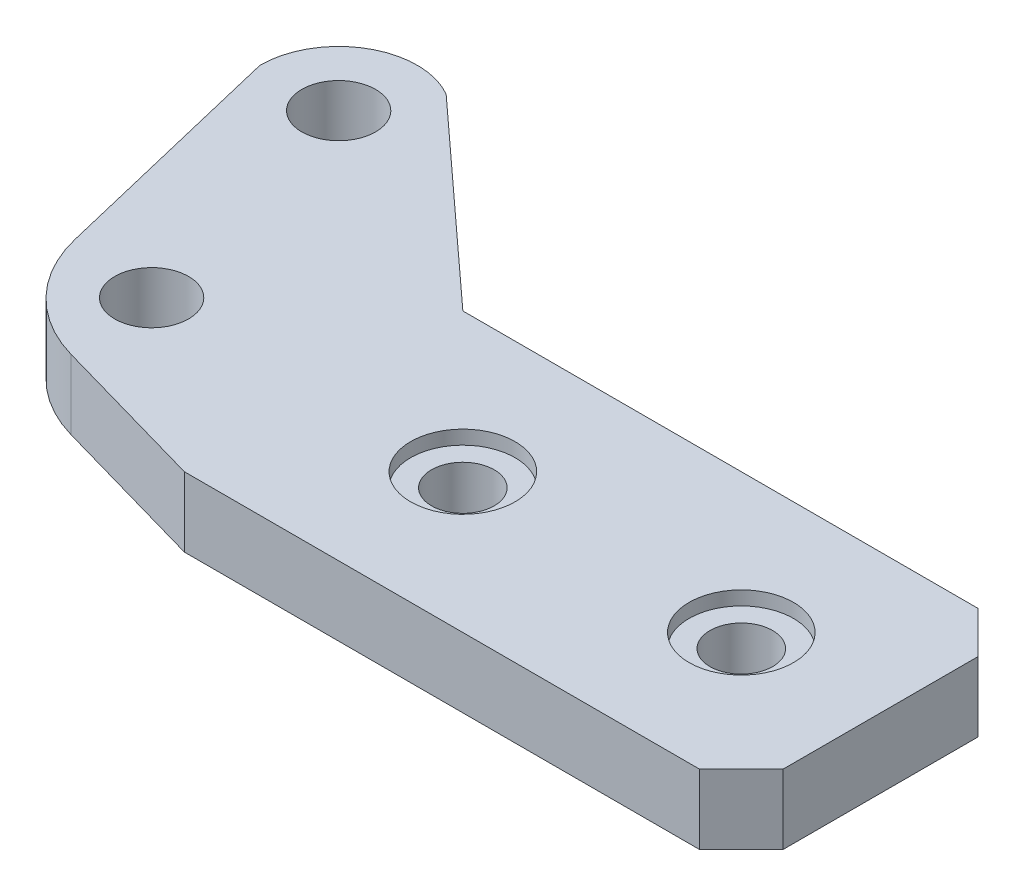
ISO-10303-21;
HEADER;
FILE_DESCRIPTION(('STEP AP214'),'2;1');
FILE_NAME('part.step','',(''),(''),'','','');
FILE_SCHEMA(('AUTOMOTIVE_DESIGN { 1 0 10303 214 1 1 1 1 }'));
ENDSEC;
DATA;
#1=APPLICATION_CONTEXT('core data for automotive mechanical design processes');
#2=APPLICATION_PROTOCOL_DEFINITION('international standard','automotive_design',2000,#1);
#3=PRODUCT_CONTEXT('',#1,'mechanical');
#4=PRODUCT('Part','Part','',(#3));
#5=PRODUCT_RELATED_PRODUCT_CATEGORY('part','',(#4));
#6=PRODUCT_DEFINITION_FORMATION('','',#4);
#7=PRODUCT_DEFINITION_CONTEXT('part definition',#1,'design');
#8=PRODUCT_DEFINITION('design','',#6,#7);
#9=PRODUCT_DEFINITION_SHAPE('','',#8);
#10=(LENGTH_UNIT() NAMED_UNIT(*) SI_UNIT(.MILLI.,.METRE.));
#11=(NAMED_UNIT(*) PLANE_ANGLE_UNIT() SI_UNIT($,.RADIAN.));
#12=(NAMED_UNIT(*) SI_UNIT($,.STERADIAN.) SOLID_ANGLE_UNIT());
#13=UNCERTAINTY_MEASURE_WITH_UNIT(LENGTH_MEASURE(1.E-05),#10,'distance_accuracy_value','');
#14=(GEOMETRIC_REPRESENTATION_CONTEXT(3) GLOBAL_UNCERTAINTY_ASSIGNED_CONTEXT((#13)) GLOBAL_UNIT_ASSIGNED_CONTEXT((#10,
#11,#12)) REPRESENTATION_CONTEXT('',''));
#15=CARTESIAN_POINT('',(0.,0.,0.));
#16=DIRECTION('',(0.,0.,1.));
#17=DIRECTION('',(1.,0.,0.));
#18=AXIS2_PLACEMENT_3D('',#15,#16,#17);
#19=CARTESIAN_POINT('',(30.,-0.00100000000000013,0.));
#20=DIRECTION('',(0.,1.,0.));
#21=DIRECTION('',(0.,0.,1.));
#22=AXIS2_PLACEMENT_3D('',#19,#20,#21);
#23=CYLINDRICAL_SURFACE('',#22,2.25);
#24=CARTESIAN_POINT('',(30.,0.,0.));
#25=DIRECTION('',(0.,1.,0.));
#26=DIRECTION('',(0.,0.,1.));
#27=AXIS2_PLACEMENT_3D('',#24,#25,#26);
#28=CIRCLE('',#27,2.25);
#29=CARTESIAN_POINT('',(30.,0.,2.25));
#30=VERTEX_POINT('',#29);
#31=EDGE_CURVE('E163',#30,#30,#28,.F.);
#32=ORIENTED_EDGE('',*,*,#31,.T.);
#33=EDGE_LOOP('',(#32));
#34=FACE_BOUND('',#33,.T.);
#35=CARTESIAN_POINT('',(30.,4.,0.));
#36=DIRECTION('',(0.,1.,0.));
#37=DIRECTION('',(0.,0.,1.));
#38=AXIS2_PLACEMENT_3D('',#35,#36,#37);
#39=CIRCLE('',#38,2.25);
#40=CARTESIAN_POINT('',(30.,4.,2.25));
#41=VERTEX_POINT('',#40);
#42=EDGE_CURVE('E159',#41,#41,#39,.F.);
#43=ORIENTED_EDGE('',*,*,#42,.F.);
#44=EDGE_LOOP('',(#43));
#45=FACE_BOUND('',#44,.T.);
#46=ADVANCED_FACE('F35',(#34,#45),#23,.F.);
#47=CARTESIAN_POINT('',(10.,-0.00100000000000013,0.));
#48=DIRECTION('',(0.,1.,0.));
#49=DIRECTION('',(0.,0.,1.));
#50=AXIS2_PLACEMENT_3D('',#47,#48,#49);
#51=CYLINDRICAL_SURFACE('',#50,2.25);
#52=CARTESIAN_POINT('',(10.,0.,0.));
#53=DIRECTION('',(0.,1.,0.));
#54=DIRECTION('',(0.,0.,1.));
#55=AXIS2_PLACEMENT_3D('',#52,#53,#54);
#56=CIRCLE('',#55,2.25);
#57=CARTESIAN_POINT('',(10.,0.,2.25));
#58=VERTEX_POINT('',#57);
#59=EDGE_CURVE('E236',#58,#58,#56,.F.);
#60=ORIENTED_EDGE('',*,*,#59,.T.);
#61=EDGE_LOOP('',(#60));
#62=FACE_BOUND('',#61,.T.);
#63=CARTESIAN_POINT('',(10.,4.,0.));
#64=DIRECTION('',(0.,1.,0.));
#65=DIRECTION('',(0.,0.,1.));
#66=AXIS2_PLACEMENT_3D('',#63,#64,#65);
#67=CIRCLE('',#66,2.25);
#68=CARTESIAN_POINT('',(10.,4.,2.25));
#69=VERTEX_POINT('',#68);
#70=EDGE_CURVE('E156',#69,#69,#67,.F.);
#71=ORIENTED_EDGE('',*,*,#70,.F.);
#72=EDGE_LOOP('',(#71));
#73=FACE_BOUND('',#72,.T.);
#74=ADVANCED_FACE('F267',(#62,#73),#51,.F.);
#75=CARTESIAN_POINT('',(-16.917561856948,5.,-18.));
#76=DIRECTION('',(0.,1.,0.));
#77=DIRECTION('',(0.,0.,1.));
#78=AXIS2_PLACEMENT_3D('',#75,#76,#77);
#79=PLANE('',#78);
#80=CARTESIAN_POINT('',(10.,5.,0.));
#81=DIRECTION('',(0.,1.,0.));
#82=DIRECTION('',(0.,0.,1.));
#83=AXIS2_PLACEMENT_3D('',#80,#81,#82);
#84=CIRCLE('',#83,3.75);
#85=CARTESIAN_POINT('',(10.,5.,3.75));
#86=VERTEX_POINT('',#85);
#87=EDGE_CURVE('E249',#86,#86,#84,.T.);
#88=ORIENTED_EDGE('',*,*,#87,.F.);
#89=EDGE_LOOP('',(#88));
#90=FACE_BOUND('',#89,.T.);
#91=CARTESIAN_POINT('',(30.,5.,0.));
#92=DIRECTION('',(0.,1.,0.));
#93=DIRECTION('',(0.,0.,1.));
#94=AXIS2_PLACEMENT_3D('',#91,#92,#93);
#95=CIRCLE('',#94,3.75000000000001);
#96=CARTESIAN_POINT('',(30.,5.,3.75000000000001));
#97=VERTEX_POINT('',#96);
#98=EDGE_CURVE('E243',#97,#97,#95,.T.);
#99=ORIENTED_EDGE('',*,*,#98,.F.);
#100=EDGE_LOOP('',(#99));
#101=FACE_BOUND('',#100,.T.);
#102=CARTESIAN_POINT('',(-16.917561856948,5.,-18.));
#103=DIRECTION('',(0.,1.,0.));
#104=DIRECTION('',(0.,0.,1.));
#105=AXIS2_PLACEMENT_3D('',#102,#103,#104);
#106=CIRCLE('',#105,2.65);
#107=CARTESIAN_POINT('',(-16.917561856948,5.,-15.35));
#108=VERTEX_POINT('',#107);
#109=EDGE_CURVE('E210',#108,#108,#106,.T.);
#110=ORIENTED_EDGE('',*,*,#109,.F.);
#111=EDGE_LOOP('',(#110));
#112=FACE_BOUND('',#111,.T.);
#113=DIRECTION('',(1.,0.,0.));
#114=VECTOR('',#113,1.);
#115=CARTESIAN_POINT('',(0.,5.,10.));
#116=LINE('',#115,#114);
#117=CARTESIAN_POINT('',(0.,5.,10.));
#118=VERTEX_POINT('',#117);
#119=CARTESIAN_POINT('',(37.,5.,10.));
#120=VERTEX_POINT('',#119);
#121=EDGE_CURVE('E176',#118,#120,#116,.T.);
#122=ORIENTED_EDGE('',*,*,#121,.T.);
#123=DIRECTION('',(-0.707106781186549,0.,0.707106781186546));
#124=VECTOR('',#123,1.);
#125=CARTESIAN_POINT('',(24.0412190715259,5.,22.958780928474));
#126=LINE('',#125,#124);
#127=CARTESIAN_POINT('',(40.,5.,6.99999999999998));
#128=VERTEX_POINT('',#127);
#129=EDGE_CURVE('E44',#120,#128,#126,.F.);
#130=ORIENTED_EDGE('',*,*,#129,.T.);
#131=DIRECTION('',(0.,0.,-1.));
#132=VECTOR('',#131,1.);
#133=CARTESIAN_POINT('',(40.,5.,-10.));
#134=LINE('',#133,#132);
#135=CARTESIAN_POINT('',(40.,5.,-6.99999999999998));
#136=VERTEX_POINT('',#135);
#137=EDGE_CURVE('E175',#128,#136,#134,.T.);
#138=ORIENTED_EDGE('',*,*,#137,.T.);
#139=DIRECTION('',(0.707106781186545,0.,0.70710678118655));
#140=VECTOR('',#139,1.);
#141=CARTESIAN_POINT('',(6.0412190715262,5.,-40.958780928474));
#142=LINE('',#141,#140);
#143=CARTESIAN_POINT('',(37.,5.,-10.));
#144=VERTEX_POINT('',#143);
#145=EDGE_CURVE('E51',#136,#144,#142,.F.);
#146=ORIENTED_EDGE('',*,*,#145,.T.);
#147=DIRECTION('',(-1.,0.,0.));
#148=VECTOR('',#147,1.);
#149=CARTESIAN_POINT('',(0.,5.,-10.));
#150=LINE('',#149,#148);
#151=CARTESIAN_POINT('',(0.,5.,-10.));
#152=VERTEX_POINT('',#151);
#153=EDGE_CURVE('E132',#144,#152,#150,.T.);
#154=ORIENTED_EDGE('',*,*,#153,.T.);
#155=DIRECTION('',(-0.737809358561146,0.,-0.675009148396961));
#156=VECTOR('',#155,1.);
#157=CARTESIAN_POINT('',(-14.092561856948,5.,-22.8930435313821));
#158=LINE('',#157,#156);
#159=CARTESIAN_POINT('',(-14.092561856948,5.,-22.8930435313821));
#160=VERTEX_POINT('',#159);
#161=EDGE_CURVE('E127',#152,#160,#158,.T.);
#162=ORIENTED_EDGE('',*,*,#161,.T.);
#163=CARTESIAN_POINT('',(-16.917561856948,5.,-18.));
#164=DIRECTION('',(0.,1.,0.));
#165=DIRECTION('',(0.,0.,1.));
#166=AXIS2_PLACEMENT_3D('',#163,#164,#165);
#167=CIRCLE('',#166,5.65);
#168=CARTESIAN_POINT('',(-22.567561856948,5.,-18.));
#169=VERTEX_POINT('',#168);
#170=EDGE_CURVE('E116',#160,#169,#167,.T.);
#171=ORIENTED_EDGE('',*,*,#170,.T.);
#172=DIRECTION('',(0.233026546643387,0.,0.972470374129442));
#173=VECTOR('',#172,1.);
#174=CARTESIAN_POINT('',(-22.567561856948,5.,-18.));
#175=LINE('',#174,#173);
#176=CARTESIAN_POINT('',(-18.3801761130349,5.,-0.525130120735899));
#177=VERTEX_POINT('',#176);
#178=EDGE_CURVE('E126',#169,#177,#175,.T.);
#179=ORIENTED_EDGE('',*,*,#178,.T.);
#180=CARTESIAN_POINT('',(-8.65547237174047,5.,-2.85539558716977));
#181=DIRECTION('',(0.,1.,0.));
#182=DIRECTION('',(0.,0.,1.));
#183=AXIS2_PLACEMENT_3D('',#180,#181,#182);
#184=CIRCLE('',#183,10.);
#185=CARTESIAN_POINT('',(-11.388826021533,5.,6.76379241521202));
#186=VERTEX_POINT('',#185);
#187=EDGE_CURVE('E153',#177,#186,#184,.T.);
#188=ORIENTED_EDGE('',*,*,#187,.T.);
#189=DIRECTION('',(0.961918800238179,0.,0.273335364979254));
#190=VECTOR('',#189,1.);
#191=CARTESIAN_POINT('',(-17.0167914423893,5.,5.16457012948533));
#192=LINE('',#191,#190);
#193=EDGE_CURVE('E221',#186,#118,#192,.T.);
#194=ORIENTED_EDGE('',*,*,#193,.T.);
#195=EDGE_LOOP('',(#122,#130,#138,#146,#154,#162,#171,#179,#188,#194));
#196=FACE_BOUND('',#195,.T.);
#197=CARTESIAN_POINT('',(-12.,5.,0.352590699492273));
#198=DIRECTION('',(0.,1.,0.));
#199=DIRECTION('',(0.,0.,1.));
#200=AXIS2_PLACEMENT_3D('',#197,#198,#199);
#201=CIRCLE('',#200,2.65);
#202=CARTESIAN_POINT('',(-12.,5.,3.00259069949227));
#203=VERTEX_POINT('',#202);
#204=EDGE_CURVE('E230',#203,#203,#201,.T.);
#205=ORIENTED_EDGE('',*,*,#204,.F.);
#206=EDGE_LOOP('',(#205));
#207=FACE_BOUND('',#206,.T.);
#208=ADVANCED_FACE('F130',(#90,#101,#112,#196,#207),#79,.T.);
#209=CARTESIAN_POINT('',(-16.917561856948,0.,-18.));
#210=DIRECTION('',(0.,1.,0.));
#211=DIRECTION('',(0.,0.,1.));
#212=AXIS2_PLACEMENT_3D('',#209,#210,#211);
#213=PLANE('',#212);
#214=ORIENTED_EDGE('',*,*,#59,.F.);
#215=EDGE_LOOP('',(#214));
#216=FACE_BOUND('',#215,.T.);
#217=ORIENTED_EDGE('',*,*,#31,.F.);
#218=EDGE_LOOP('',(#217));
#219=FACE_BOUND('',#218,.T.);
#220=DIRECTION('',(0.,0.,-1.));
#221=VECTOR('',#220,1.);
#222=CARTESIAN_POINT('',(40.,0.,-10.));
#223=LINE('',#222,#221);
#224=CARTESIAN_POINT('',(40.,0.,6.99999999999998));
#225=VERTEX_POINT('',#224);
#226=CARTESIAN_POINT('',(40.,0.,-6.99999999999998));
#227=VERTEX_POINT('',#226);
#228=EDGE_CURVE('E192',#225,#227,#223,.T.);
#229=ORIENTED_EDGE('',*,*,#228,.F.);
#230=DIRECTION('',(0.707106781186549,0.,-0.707106781186546));
#231=VECTOR('',#230,1.);
#232=CARTESIAN_POINT('',(40.,0.,6.99999999999998));
#233=LINE('',#232,#231);
#234=CARTESIAN_POINT('',(37.,0.,10.));
#235=VERTEX_POINT('',#234);
#236=EDGE_CURVE('E170',#225,#235,#233,.F.);
#237=ORIENTED_EDGE('',*,*,#236,.T.);
#238=DIRECTION('',(1.,0.,0.));
#239=VECTOR('',#238,1.);
#240=CARTESIAN_POINT('',(0.,0.,10.));
#241=LINE('',#240,#239);
#242=CARTESIAN_POINT('',(0.,0.,10.));
#243=VERTEX_POINT('',#242);
#244=EDGE_CURVE('E191',#243,#235,#241,.T.);
#245=ORIENTED_EDGE('',*,*,#244,.F.);
#246=DIRECTION('',(0.961918800238179,0.,0.273335364979254));
#247=VECTOR('',#246,1.);
#248=CARTESIAN_POINT('',(-17.0167914423893,0.,5.16457012948533));
#249=LINE('',#248,#247);
#250=CARTESIAN_POINT('',(-11.388826021533,0.,6.76379241521202));
#251=VERTEX_POINT('',#250);
#252=EDGE_CURVE('E196',#251,#243,#249,.T.);
#253=ORIENTED_EDGE('',*,*,#252,.F.);
#254=CARTESIAN_POINT('',(-8.65547237174047,0.,-2.85539558716977));
#255=DIRECTION('',(0.,1.,0.));
#256=DIRECTION('',(0.,0.,1.));
#257=AXIS2_PLACEMENT_3D('',#254,#255,#256);
#258=CIRCLE('',#257,10.);
#259=CARTESIAN_POINT('',(-18.3801761130349,0.,-0.525130120735899));
#260=VERTEX_POINT('',#259);
#261=EDGE_CURVE('E144',#251,#260,#258,.F.);
#262=ORIENTED_EDGE('',*,*,#261,.T.);
#263=DIRECTION('',(0.233026546643387,0.,0.972470374129442));
#264=VECTOR('',#263,1.);
#265=CARTESIAN_POINT('',(-22.567561856948,0.,-18.));
#266=LINE('',#265,#264);
#267=CARTESIAN_POINT('',(-22.567561856948,0.,-18.));
#268=VERTEX_POINT('',#267);
#269=EDGE_CURVE('E199',#268,#260,#266,.T.);
#270=ORIENTED_EDGE('',*,*,#269,.F.);
#271=CARTESIAN_POINT('',(-16.917561856948,0.,-18.));
#272=DIRECTION('',(0.,1.,0.));
#273=DIRECTION('',(0.,0.,1.));
#274=AXIS2_PLACEMENT_3D('',#271,#272,#273);
#275=CIRCLE('',#274,5.65);
#276=CARTESIAN_POINT('',(-14.092561856948,0.,-22.8930435313821));
#277=VERTEX_POINT('',#276);
#278=EDGE_CURVE('E209',#277,#268,#275,.T.);
#279=ORIENTED_EDGE('',*,*,#278,.F.);
#280=DIRECTION('',(-0.737809358561146,0.,-0.675009148396961));
#281=VECTOR('',#280,1.);
#282=CARTESIAN_POINT('',(-14.092561856948,0.,-22.8930435313821));
#283=LINE('',#282,#281);
#284=CARTESIAN_POINT('',(0.,0.,-10.));
#285=VERTEX_POINT('',#284);
#286=EDGE_CURVE('E140',#285,#277,#283,.T.);
#287=ORIENTED_EDGE('',*,*,#286,.F.);
#288=DIRECTION('',(-1.,0.,0.));
#289=VECTOR('',#288,1.);
#290=CARTESIAN_POINT('',(0.,0.,-10.));
#291=LINE('',#290,#289);
#292=CARTESIAN_POINT('',(37.,0.,-10.));
#293=VERTEX_POINT('',#292);
#294=EDGE_CURVE('E136',#293,#285,#291,.T.);
#295=ORIENTED_EDGE('',*,*,#294,.F.);
#296=DIRECTION('',(-0.707106781186545,0.,-0.70710678118655));
#297=VECTOR('',#296,1.);
#298=CARTESIAN_POINT('',(37.,0.,-10.));
#299=LINE('',#298,#297);
#300=EDGE_CURVE('E168',#293,#227,#299,.F.);
#301=ORIENTED_EDGE('',*,*,#300,.T.);
#302=EDGE_LOOP('',(#229,#237,#245,#253,#262,#270,#279,#287,#295,#301));
#303=FACE_BOUND('',#302,.T.);
#304=CARTESIAN_POINT('',(-16.917561856948,0.,-18.));
#305=DIRECTION('',(0.,1.,0.));
#306=DIRECTION('',(0.,0.,1.));
#307=AXIS2_PLACEMENT_3D('',#304,#305,#306);
#308=CIRCLE('',#307,2.65);
#309=CARTESIAN_POINT('',(-16.917561856948,0.,-15.35));
#310=VERTEX_POINT('',#309);
#311=EDGE_CURVE('E227',#310,#310,#308,.T.);
#312=ORIENTED_EDGE('',*,*,#311,.T.);
#313=EDGE_LOOP('',(#312));
#314=FACE_BOUND('',#313,.T.);
#315=CARTESIAN_POINT('',(-12.,0.,0.352590699492273));
#316=DIRECTION('',(0.,1.,0.));
#317=DIRECTION('',(0.,0.,1.));
#318=AXIS2_PLACEMENT_3D('',#315,#316,#317);
#319=CIRCLE('',#318,2.65);
#320=CARTESIAN_POINT('',(-12.,0.,3.00259069949227));
#321=VERTEX_POINT('',#320);
#322=EDGE_CURVE('E233',#321,#321,#319,.T.);
#323=ORIENTED_EDGE('',*,*,#322,.T.);
#324=EDGE_LOOP('',(#323));
#325=FACE_BOUND('',#324,.T.);
#326=ADVANCED_FACE('F188',(#216,#219,#303,#314,#325),#213,.F.);
#327=CARTESIAN_POINT('',(-14.092561856948,5.,-22.8930435313821));
#328=DIRECTION('',(-0.675009148396961,0.,0.737809358561146));
#329=DIRECTION('',(0.737809358561146,0.,0.675009148396961));
#330=AXIS2_PLACEMENT_3D('',#327,#328,#329);
#331=PLANE('',#330);
#332=ORIENTED_EDGE('',*,*,#286,.T.);
#333=DIRECTION('',(0.,-1.,0.));
#334=VECTOR('',#333,1.);
#335=CARTESIAN_POINT('',(-14.092561856948,5.,-22.8930435313821));
#336=LINE('',#335,#334);
#337=EDGE_CURVE('E120',#160,#277,#336,.T.);
#338=ORIENTED_EDGE('',*,*,#337,.F.);
#339=ORIENTED_EDGE('',*,*,#161,.F.);
#340=DIRECTION('',(0.,-1.,0.));
#341=VECTOR('',#340,1.);
#342=CARTESIAN_POINT('',(0.,5.,-10.));
#343=LINE('',#342,#341);
#344=EDGE_CURVE('E204',#152,#285,#343,.T.);
#345=ORIENTED_EDGE('',*,*,#344,.T.);
#346=EDGE_LOOP('',(#332,#338,#339,#345));
#347=FACE_BOUND('',#346,.T.);
#348=ADVANCED_FACE('F138',(#347),#331,.F.);
#349=CARTESIAN_POINT('',(-16.917561856948,5.,-18.));
#350=DIRECTION('',(0.,-1.,0.));
#351=DIRECTION('',(0.,0.,-1.));
#352=AXIS2_PLACEMENT_3D('',#349,#350,#351);
#353=CYLINDRICAL_SURFACE('',#352,5.65);
#354=ORIENTED_EDGE('',*,*,#278,.T.);
#355=DIRECTION('',(0.,-1.,0.));
#356=VECTOR('',#355,1.);
#357=CARTESIAN_POINT('',(-22.567561856948,5.,-18.));
#358=LINE('',#357,#356);
#359=EDGE_CURVE('E123',#169,#268,#358,.T.);
#360=ORIENTED_EDGE('',*,*,#359,.F.);
#361=ORIENTED_EDGE('',*,*,#170,.F.);
#362=ORIENTED_EDGE('',*,*,#337,.T.);
#363=EDGE_LOOP('',(#354,#360,#361,#362));
#364=FACE_BOUND('',#363,.T.);
#365=ADVANCED_FACE('F118',(#364),#353,.T.);
#366=CARTESIAN_POINT('',(-22.567561856948,5.,-18.));
#367=DIRECTION('',(0.972470374129442,0.,-0.233026546643387));
#368=DIRECTION('',(-0.233026546643387,0.,-0.972470374129442));
#369=AXIS2_PLACEMENT_3D('',#366,#367,#368);
#370=PLANE('',#369);
#371=ORIENTED_EDGE('',*,*,#269,.T.);
#372=DIRECTION('',(0.,-1.,0.));
#373=VECTOR('',#372,1.);
#374=CARTESIAN_POINT('',(-18.3801761130349,5.,-0.525130120735903));
#375=LINE('',#374,#373);
#376=EDGE_CURVE('E151',#260,#177,#375,.F.);
#377=ORIENTED_EDGE('',*,*,#376,.T.);
#378=ORIENTED_EDGE('',*,*,#178,.F.);
#379=ORIENTED_EDGE('',*,*,#359,.T.);
#380=EDGE_LOOP('',(#371,#377,#378,#379));
#381=FACE_BOUND('',#380,.T.);
#382=ADVANCED_FACE('F215',(#381),#370,.F.);
#383=CARTESIAN_POINT('',(-17.0167914423893,5.,5.16457012948533));
#384=DIRECTION('',(0.273335364979254,0.,-0.961918800238179));
#385=DIRECTION('',(-0.961918800238179,0.,-0.273335364979254));
#386=AXIS2_PLACEMENT_3D('',#383,#384,#385);
#387=PLANE('',#386);
#388=ORIENTED_EDGE('',*,*,#193,.F.);
#389=DIRECTION('',(0.,-1.,0.));
#390=VECTOR('',#389,1.);
#391=CARTESIAN_POINT('',(-11.388826021533,5.,6.76379241521202));
#392=LINE('',#391,#390);
#393=EDGE_CURVE('E141',#186,#251,#392,.T.);
#394=ORIENTED_EDGE('',*,*,#393,.T.);
#395=ORIENTED_EDGE('',*,*,#252,.T.);
#396=DIRECTION('',(0.,-1.,0.));
#397=VECTOR('',#396,1.);
#398=CARTESIAN_POINT('',(0.,5.,10.));
#399=LINE('',#398,#397);
#400=EDGE_CURVE('E146',#118,#243,#399,.T.);
#401=ORIENTED_EDGE('',*,*,#400,.F.);
#402=EDGE_LOOP('',(#388,#394,#395,#401));
#403=FACE_BOUND('',#402,.T.);
#404=ADVANCED_FACE('F223',(#403),#387,.F.);
#405=CARTESIAN_POINT('',(0.,5.,10.));
#406=DIRECTION('',(0.,0.,-1.));
#407=DIRECTION('',(-1.,0.,0.));
#408=AXIS2_PLACEMENT_3D('',#405,#406,#407);
#409=PLANE('',#408);
#410=ORIENTED_EDGE('',*,*,#244,.T.);
#411=DIRECTION('',(0.,1.,0.));
#412=VECTOR('',#411,1.);
#413=CARTESIAN_POINT('',(37.,5.,10.));
#414=LINE('',#413,#412);
#415=EDGE_CURVE('E59',#235,#120,#414,.T.);
#416=ORIENTED_EDGE('',*,*,#415,.T.);
#417=ORIENTED_EDGE('',*,*,#121,.F.);
#418=ORIENTED_EDGE('',*,*,#400,.T.);
#419=EDGE_LOOP('',(#410,#416,#417,#418));
#420=FACE_BOUND('',#419,.T.);
#421=ADVANCED_FACE('F194',(#420),#409,.F.);
#422=CARTESIAN_POINT('',(40.,5.,-10.));
#423=DIRECTION('',(-1.,0.,0.));
#424=DIRECTION('',(0.,0.,1.));
#425=AXIS2_PLACEMENT_3D('',#422,#423,#424);
#426=PLANE('',#425);
#427=ORIENTED_EDGE('',*,*,#137,.F.);
#428=DIRECTION('',(0.,-1.,0.));
#429=VECTOR('',#428,1.);
#430=CARTESIAN_POINT('',(40.,5.,6.99999999999998));
#431=LINE('',#430,#429);
#432=EDGE_CURVE('E165',#128,#225,#431,.T.);
#433=ORIENTED_EDGE('',*,*,#432,.T.);
#434=ORIENTED_EDGE('',*,*,#228,.T.);
#435=DIRECTION('',(0.,1.,0.));
#436=VECTOR('',#435,1.);
#437=CARTESIAN_POINT('',(40.,5.,-6.99999999999998));
#438=LINE('',#437,#436);
#439=EDGE_CURVE('E155',#227,#136,#438,.T.);
#440=ORIENTED_EDGE('',*,*,#439,.T.);
#441=EDGE_LOOP('',(#427,#433,#434,#440));
#442=FACE_BOUND('',#441,.T.);
#443=ADVANCED_FACE('F180',(#442),#426,.F.);
#444=CARTESIAN_POINT('',(0.,5.,-10.));
#445=DIRECTION('',(0.,0.,1.));
#446=DIRECTION('',(1.,0.,0.));
#447=AXIS2_PLACEMENT_3D('',#444,#445,#446);
#448=PLANE('',#447);
#449=ORIENTED_EDGE('',*,*,#153,.F.);
#450=DIRECTION('',(0.,-1.,0.));
#451=VECTOR('',#450,1.);
#452=CARTESIAN_POINT('',(37.,5.,-10.));
#453=LINE('',#452,#451);
#454=EDGE_CURVE('E11',#144,#293,#453,.T.);
#455=ORIENTED_EDGE('',*,*,#454,.T.);
#456=ORIENTED_EDGE('',*,*,#294,.T.);
#457=ORIENTED_EDGE('',*,*,#344,.F.);
#458=EDGE_LOOP('',(#449,#455,#456,#457));
#459=FACE_BOUND('',#458,.T.);
#460=ADVANCED_FACE('F277',(#459),#448,.F.);
#461=CARTESIAN_POINT('',(-16.917561856948,5.,-18.));
#462=DIRECTION('',(0.,-1.,0.));
#463=DIRECTION('',(0.,0.,-1.));
#464=AXIS2_PLACEMENT_3D('',#461,#462,#463);
#465=CYLINDRICAL_SURFACE('',#464,2.65);
#466=ORIENTED_EDGE('',*,*,#109,.T.);
#467=EDGE_LOOP('',(#466));
#468=FACE_BOUND('',#467,.T.);
#469=ORIENTED_EDGE('',*,*,#311,.F.);
#470=EDGE_LOOP('',(#469));
#471=FACE_BOUND('',#470,.T.);
#472=ADVANCED_FACE('F273',(#468,#471),#465,.F.);
#473=CARTESIAN_POINT('',(-12.,5.,0.352590699492273));
#474=DIRECTION('',(0.,-1.,0.));
#475=DIRECTION('',(0.,0.,-1.));
#476=AXIS2_PLACEMENT_3D('',#473,#474,#475);
#477=CYLINDRICAL_SURFACE('',#476,2.65);
#478=ORIENTED_EDGE('',*,*,#204,.T.);
#479=EDGE_LOOP('',(#478));
#480=FACE_BOUND('',#479,.T.);
#481=ORIENTED_EDGE('',*,*,#322,.F.);
#482=EDGE_LOOP('',(#481));
#483=FACE_BOUND('',#482,.T.);
#484=ADVANCED_FACE('F276',(#480,#483),#477,.F.);
#485=CARTESIAN_POINT('',(-8.65547237174047,5.,-2.85539558716977));
#486=DIRECTION('',(0.,-1.,0.));
#487=DIRECTION('',(0.,0.,-1.));
#488=AXIS2_PLACEMENT_3D('',#485,#486,#487);
#489=CYLINDRICAL_SURFACE('',#488,10.);
#490=ORIENTED_EDGE('',*,*,#187,.F.);
#491=ORIENTED_EDGE('',*,*,#376,.F.);
#492=ORIENTED_EDGE('',*,*,#261,.F.);
#493=ORIENTED_EDGE('',*,*,#393,.F.);
#494=EDGE_LOOP('',(#490,#491,#492,#493));
#495=FACE_BOUND('',#494,.T.);
#496=ADVANCED_FACE('F218',(#495),#489,.T.);
#497=CARTESIAN_POINT('',(10.,4.,0.));
#498=DIRECTION('',(0.,1.,0.));
#499=DIRECTION('',(0.,0.,1.));
#500=AXIS2_PLACEMENT_3D('',#497,#498,#499);
#501=PLANE('',#500);
#502=CARTESIAN_POINT('',(10.,4.,0.));
#503=DIRECTION('',(0.,1.,0.));
#504=DIRECTION('',(0.,0.,1.));
#505=AXIS2_PLACEMENT_3D('',#502,#503,#504);
#506=CIRCLE('',#505,3.75);
#507=CARTESIAN_POINT('',(10.,4.,3.75));
#508=VERTEX_POINT('',#507);
#509=EDGE_CURVE('E160',#508,#508,#506,.T.);
#510=ORIENTED_EDGE('',*,*,#509,.T.);
#511=EDGE_LOOP('',(#510));
#512=FACE_BOUND('',#511,.T.);
#513=ORIENTED_EDGE('',*,*,#70,.T.);
#514=EDGE_LOOP('',(#513));
#515=FACE_BOUND('',#514,.T.);
#516=ADVANCED_FACE('F255',(#512,#515),#501,.T.);
#517=CARTESIAN_POINT('',(10.,4.,0.));
#518=DIRECTION('',(0.,1.,0.));
#519=DIRECTION('',(0.,0.,1.));
#520=AXIS2_PLACEMENT_3D('',#517,#518,#519);
#521=CYLINDRICAL_SURFACE('',#520,3.75);
#522=ORIENTED_EDGE('',*,*,#509,.F.);
#523=EDGE_LOOP('',(#522));
#524=FACE_BOUND('',#523,.T.);
#525=ORIENTED_EDGE('',*,*,#87,.T.);
#526=EDGE_LOOP('',(#525));
#527=FACE_BOUND('',#526,.T.);
#528=ADVANCED_FACE('F258',(#524,#527),#521,.F.);
#529=CARTESIAN_POINT('',(30.,4.,0.));
#530=DIRECTION('',(0.,1.,0.));
#531=DIRECTION('',(0.,0.,1.));
#532=AXIS2_PLACEMENT_3D('',#529,#530,#531);
#533=PLANE('',#532);
#534=CARTESIAN_POINT('',(30.,4.,0.));
#535=DIRECTION('',(0.,1.,0.));
#536=DIRECTION('',(0.,0.,1.));
#537=AXIS2_PLACEMENT_3D('',#534,#535,#536);
#538=CIRCLE('',#537,3.75000000000001);
#539=CARTESIAN_POINT('',(30.,4.,3.75000000000001));
#540=VERTEX_POINT('',#539);
#541=EDGE_CURVE('E246',#540,#540,#538,.T.);
#542=ORIENTED_EDGE('',*,*,#541,.T.);
#543=EDGE_LOOP('',(#542));
#544=FACE_BOUND('',#543,.T.);
#545=ORIENTED_EDGE('',*,*,#42,.T.);
#546=EDGE_LOOP('',(#545));
#547=FACE_BOUND('',#546,.T.);
#548=ADVANCED_FACE('F261',(#544,#547),#533,.T.);
#549=CARTESIAN_POINT('',(30.,4.,0.));
#550=DIRECTION('',(0.,1.,0.));
#551=DIRECTION('',(0.,0.,1.));
#552=AXIS2_PLACEMENT_3D('',#549,#550,#551);
#553=CYLINDRICAL_SURFACE('',#552,3.75000000000001);
#554=ORIENTED_EDGE('',*,*,#541,.F.);
#555=EDGE_LOOP('',(#554));
#556=FACE_BOUND('',#555,.T.);
#557=ORIENTED_EDGE('',*,*,#98,.T.);
#558=EDGE_LOOP('',(#557));
#559=FACE_BOUND('',#558,.T.);
#560=ADVANCED_FACE('F303',(#556,#559),#553,.F.);
#561=CARTESIAN_POINT('',(40.,5.,6.99999999999998));
#562=DIRECTION('',(-0.707106781186546,0.,-0.707106781186549));
#563=DIRECTION('',(0.,-1.,0.));
#564=AXIS2_PLACEMENT_3D('',#561,#562,#563);
#565=PLANE('',#564);
#566=ORIENTED_EDGE('',*,*,#129,.F.);
#567=ORIENTED_EDGE('',*,*,#415,.F.);
#568=ORIENTED_EDGE('',*,*,#236,.F.);
#569=ORIENTED_EDGE('',*,*,#432,.F.);
#570=EDGE_LOOP('',(#566,#567,#568,#569));
#571=FACE_BOUND('',#570,.T.);
#572=ADVANCED_FACE('F185',(#571),#565,.F.);
#573=CARTESIAN_POINT('',(37.,5.,-10.));
#574=DIRECTION('',(-0.70710678118655,0.,0.707106781186545));
#575=DIRECTION('',(0.,-1.,0.));
#576=AXIS2_PLACEMENT_3D('',#573,#574,#575);
#577=PLANE('',#576);
#578=ORIENTED_EDGE('',*,*,#145,.F.);
#579=ORIENTED_EDGE('',*,*,#439,.F.);
#580=ORIENTED_EDGE('',*,*,#300,.F.);
#581=ORIENTED_EDGE('',*,*,#454,.F.);
#582=EDGE_LOOP('',(#578,#579,#580,#581));
#583=FACE_BOUND('',#582,.T.);
#584=ADVANCED_FACE('F38',(#583),#577,.F.);
#585=CLOSED_SHELL('',(#46,#74,#208,#326,#348,#365,#382,#404,#421,#443,#460,#472,#484,#496,#516,
#528,#548,#560,#572,#584));
#586=MANIFOLD_SOLID_BREP('B2',#585);
#587=ADVANCED_BREP_SHAPE_REPRESENTATION('',(#18,#586),#14);
#588=SHAPE_DEFINITION_REPRESENTATION(#9,#587);
ENDSEC;
END-ISO-10303-21;
